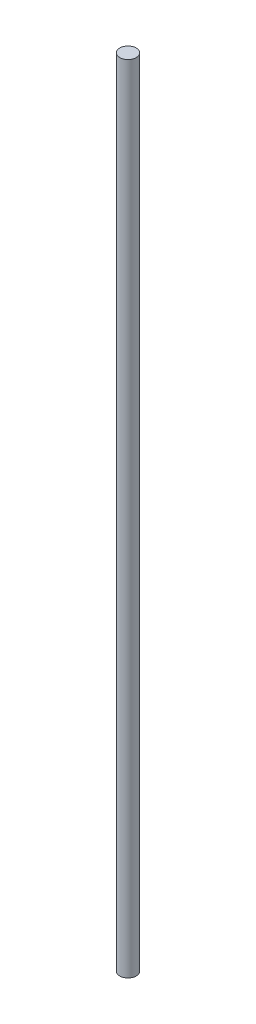
ISO-10303-21;
HEADER;
FILE_DESCRIPTION(('STEP AP214'),'2;1');
FILE_NAME('part.step','',(''),(''),'','','');
FILE_SCHEMA(('AUTOMOTIVE_DESIGN { 1 0 10303 214 1 1 1 1 }'));
ENDSEC;
DATA;
#1=APPLICATION_CONTEXT('core data for automotive mechanical design processes');
#2=APPLICATION_PROTOCOL_DEFINITION('international standard','automotive_design',2000,#1);
#3=PRODUCT_CONTEXT('',#1,'mechanical');
#4=PRODUCT('Part','Part','',(#3));
#5=PRODUCT_RELATED_PRODUCT_CATEGORY('part','',(#4));
#6=PRODUCT_DEFINITION_FORMATION('','',#4);
#7=PRODUCT_DEFINITION_CONTEXT('part definition',#1,'design');
#8=PRODUCT_DEFINITION('design','',#6,#7);
#9=PRODUCT_DEFINITION_SHAPE('','',#8);
#10=(LENGTH_UNIT() NAMED_UNIT(*) SI_UNIT(.MILLI.,.METRE.));
#11=(NAMED_UNIT(*) PLANE_ANGLE_UNIT() SI_UNIT($,.RADIAN.));
#12=(NAMED_UNIT(*) SI_UNIT($,.STERADIAN.) SOLID_ANGLE_UNIT());
#13=UNCERTAINTY_MEASURE_WITH_UNIT(LENGTH_MEASURE(1.E-05),#10,'distance_accuracy_value','');
#14=(GEOMETRIC_REPRESENTATION_CONTEXT(3) GLOBAL_UNCERTAINTY_ASSIGNED_CONTEXT((#13)) GLOBAL_UNIT_ASSIGNED_CONTEXT((#10,
#11,#12)) REPRESENTATION_CONTEXT('',''));
#15=CARTESIAN_POINT('',(0.,0.,0.));
#16=DIRECTION('',(0.,0.,1.));
#17=DIRECTION('',(1.,0.,0.));
#18=AXIS2_PLACEMENT_3D('',#15,#16,#17);
#19=CARTESIAN_POINT('',(0.,228.6,0.));
#20=DIRECTION('',(0.,-1.,0.));
#21=DIRECTION('',(0.,0.,-1.));
#22=AXIS2_PLACEMENT_3D('',#19,#20,#21);
#23=CYLINDRICAL_SURFACE('',#22,2.38125);
#24=CARTESIAN_POINT('',(0.,228.6,0.));
#25=DIRECTION('',(0.,1.,0.));
#26=DIRECTION('',(0.,0.,1.));
#27=AXIS2_PLACEMENT_3D('',#24,#25,#26);
#28=CIRCLE('',#27,2.38125);
#29=CARTESIAN_POINT('',(0.,228.6,2.38125));
#30=VERTEX_POINT('',#29);
#31=EDGE_CURVE('E10',#30,#30,#28,.T.);
#32=ORIENTED_EDGE('',*,*,#31,.F.);
#33=EDGE_LOOP('',(#32));
#34=FACE_BOUND('',#33,.T.);
#35=CARTESIAN_POINT('',(0.,0.,0.));
#36=DIRECTION('',(0.,1.,0.));
#37=DIRECTION('',(0.,0.,1.));
#38=AXIS2_PLACEMENT_3D('',#35,#36,#37);
#39=CIRCLE('',#38,2.38125);
#40=CARTESIAN_POINT('',(0.,0.,2.38125));
#41=VERTEX_POINT('',#40);
#42=EDGE_CURVE('E34',#41,#41,#39,.T.);
#43=ORIENTED_EDGE('',*,*,#42,.T.);
#44=EDGE_LOOP('',(#43));
#45=FACE_BOUND('',#44,.T.);
#46=ADVANCED_FACE('F31',(#34,#45),#23,.T.);
#47=CARTESIAN_POINT('',(0.,228.6,0.));
#48=DIRECTION('',(0.,1.,0.));
#49=DIRECTION('',(0.,0.,1.));
#50=AXIS2_PLACEMENT_3D('',#47,#48,#49);
#51=PLANE('',#50);
#52=ORIENTED_EDGE('',*,*,#31,.T.);
#53=EDGE_LOOP('',(#52));
#54=FACE_BOUND('',#53,.T.);
#55=ADVANCED_FACE('F46',(#54),#51,.T.);
#56=CARTESIAN_POINT('',(0.,0.,0.));
#57=DIRECTION('',(0.,1.,0.));
#58=DIRECTION('',(0.,0.,1.));
#59=AXIS2_PLACEMENT_3D('',#56,#57,#58);
#60=PLANE('',#59);
#61=ORIENTED_EDGE('',*,*,#42,.F.);
#62=EDGE_LOOP('',(#61));
#63=FACE_BOUND('',#62,.T.);
#64=ADVANCED_FACE('F44',(#63),#60,.F.);
#65=CLOSED_SHELL('',(#46,#55,#64));
#66=MANIFOLD_SOLID_BREP('B2',#65);
#67=ADVANCED_BREP_SHAPE_REPRESENTATION('',(#18,#66),#14);
#68=SHAPE_DEFINITION_REPRESENTATION(#9,#67);
ENDSEC;
END-ISO-10303-21;
